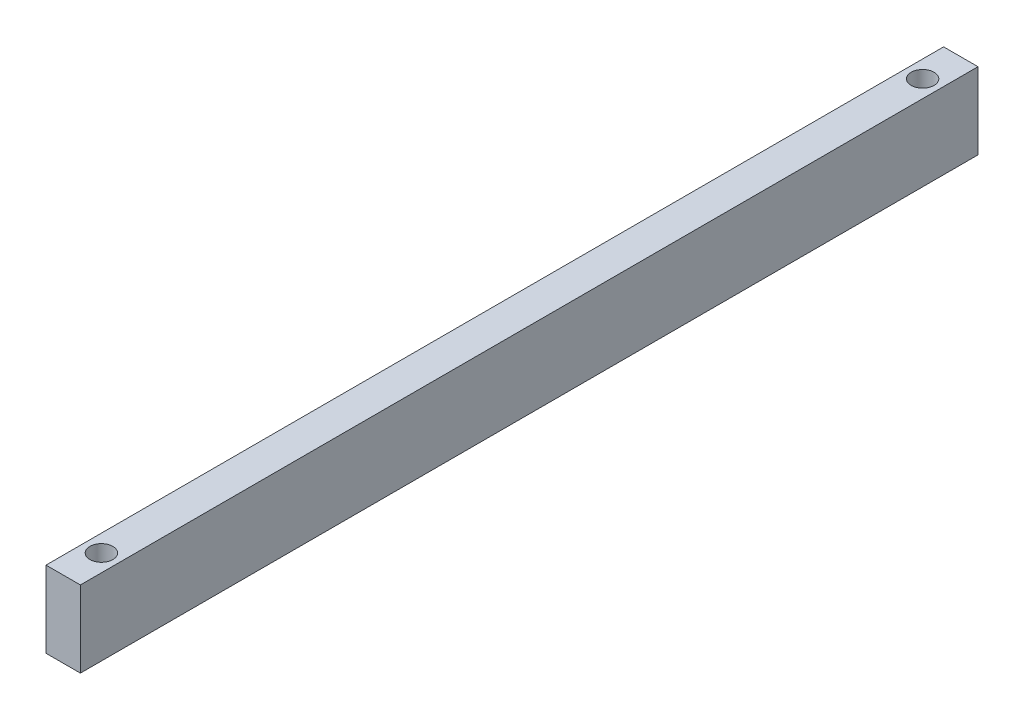
ISO-10303-21;
HEADER;
FILE_DESCRIPTION(('STEP AP214'),'2;1');
FILE_NAME('part.step','',(''),(''),'','','');
FILE_SCHEMA(('AUTOMOTIVE_DESIGN { 1 0 10303 214 1 1 1 1 }'));
ENDSEC;
DATA;
#1=APPLICATION_CONTEXT('core data for automotive mechanical design processes');
#2=APPLICATION_PROTOCOL_DEFINITION('international standard','automotive_design',2000,#1);
#3=PRODUCT_CONTEXT('',#1,'mechanical');
#4=PRODUCT('Part','Part','',(#3));
#5=PRODUCT_RELATED_PRODUCT_CATEGORY('part','',(#4));
#6=PRODUCT_DEFINITION_FORMATION('','',#4);
#7=PRODUCT_DEFINITION_CONTEXT('part definition',#1,'design');
#8=PRODUCT_DEFINITION('design','',#6,#7);
#9=PRODUCT_DEFINITION_SHAPE('','',#8);
#10=(LENGTH_UNIT() NAMED_UNIT(*) SI_UNIT(.MILLI.,.METRE.));
#11=(NAMED_UNIT(*) PLANE_ANGLE_UNIT() SI_UNIT($,.RADIAN.));
#12=(NAMED_UNIT(*) SI_UNIT($,.STERADIAN.) SOLID_ANGLE_UNIT());
#13=UNCERTAINTY_MEASURE_WITH_UNIT(LENGTH_MEASURE(1.E-05),#10,'distance_accuracy_value','');
#14=(GEOMETRIC_REPRESENTATION_CONTEXT(3) GLOBAL_UNCERTAINTY_ASSIGNED_CONTEXT((#13)) GLOBAL_UNIT_ASSIGNED_CONTEXT((#10,
#11,#12)) REPRESENTATION_CONTEXT('',''));
#15=CARTESIAN_POINT('',(0.,0.,0.));
#16=DIRECTION('',(0.,0.,1.));
#17=DIRECTION('',(1.,0.,0.));
#18=AXIS2_PLACEMENT_3D('',#15,#16,#17);
#19=CARTESIAN_POINT('',(4.5,-10.,117.5));
#20=DIRECTION('',(-1.,0.,0.));
#21=DIRECTION('',(0.,0.,1.));
#22=AXIS2_PLACEMENT_3D('',#19,#20,#21);
#23=PLANE('',#22);
#24=DIRECTION('',(0.,1.,0.));
#25=VECTOR('',#24,1.);
#26=CARTESIAN_POINT('',(4.5,-10.,-117.5));
#27=LINE('',#26,#25);
#28=CARTESIAN_POINT('',(4.5,-10.,-117.5));
#29=VERTEX_POINT('',#28);
#30=CARTESIAN_POINT('',(4.5,10.,-117.5));
#31=VERTEX_POINT('',#30);
#32=EDGE_CURVE('E112',#29,#31,#27,.T.);
#33=ORIENTED_EDGE('',*,*,#32,.T.);
#34=DIRECTION('',(0.,0.,-1.));
#35=VECTOR('',#34,1.);
#36=CARTESIAN_POINT('',(4.5,10.,117.5));
#37=LINE('',#36,#35);
#38=CARTESIAN_POINT('',(4.5,10.,117.5));
#39=VERTEX_POINT('',#38);
#40=EDGE_CURVE('E11',#39,#31,#37,.T.);
#41=ORIENTED_EDGE('',*,*,#40,.F.);
#42=DIRECTION('',(0.,1.,0.));
#43=VECTOR('',#42,1.);
#44=CARTESIAN_POINT('',(4.5,-10.,117.5));
#45=LINE('',#44,#43);
#46=CARTESIAN_POINT('',(4.5,-10.,117.5));
#47=VERTEX_POINT('',#46);
#48=EDGE_CURVE('E96',#47,#39,#45,.T.);
#49=ORIENTED_EDGE('',*,*,#48,.F.);
#50=DIRECTION('',(0.,0.,-1.));
#51=VECTOR('',#50,1.);
#52=CARTESIAN_POINT('',(4.5,-10.,117.5));
#53=LINE('',#52,#51);
#54=EDGE_CURVE('E108',#47,#29,#53,.T.);
#55=ORIENTED_EDGE('',*,*,#54,.T.);
#56=EDGE_LOOP('',(#33,#41,#49,#55));
#57=FACE_BOUND('',#56,.T.);
#58=ADVANCED_FACE('F44',(#57),#23,.F.);
#59=CARTESIAN_POINT('',(-4.5,10.,117.5));
#60=DIRECTION('',(0.,-1.,0.));
#61=DIRECTION('',(0.,0.,-1.));
#62=AXIS2_PLACEMENT_3D('',#59,#60,#61);
#63=PLANE('',#62);
#64=CARTESIAN_POINT('',(0.,10.,-107.5));
#65=DIRECTION('',(0.,-1.,0.));
#66=DIRECTION('',(0.,0.,-1.));
#67=AXIS2_PLACEMENT_3D('',#64,#65,#66);
#68=CIRCLE('',#67,3.);
#69=CARTESIAN_POINT('',(0.,10.,-110.5));
#70=VERTEX_POINT('',#69);
#71=EDGE_CURVE('E141',#70,#70,#68,.T.);
#72=ORIENTED_EDGE('',*,*,#71,.T.);
#73=EDGE_LOOP('',(#72));
#74=FACE_BOUND('',#73,.T.);
#75=CARTESIAN_POINT('',(0.,10.,107.5));
#76=DIRECTION('',(0.,1.,0.));
#77=DIRECTION('',(0.,0.,1.));
#78=AXIS2_PLACEMENT_3D('',#75,#76,#77);
#79=CIRCLE('',#78,3.);
#80=CARTESIAN_POINT('',(0.,10.,110.5));
#81=VERTEX_POINT('',#80);
#82=EDGE_CURVE('E133',#81,#81,#79,.T.);
#83=ORIENTED_EDGE('',*,*,#82,.F.);
#84=EDGE_LOOP('',(#83));
#85=FACE_BOUND('',#84,.T.);
#86=DIRECTION('',(-1.,0.,0.));
#87=VECTOR('',#86,1.);
#88=CARTESIAN_POINT('',(-4.5,10.,-117.5));
#89=LINE('',#88,#87);
#90=CARTESIAN_POINT('',(-4.5,10.,-117.5));
#91=VERTEX_POINT('',#90);
#92=EDGE_CURVE('E101',#31,#91,#89,.T.);
#93=ORIENTED_EDGE('',*,*,#92,.T.);
#94=DIRECTION('',(0.,0.,-1.));
#95=VECTOR('',#94,1.);
#96=CARTESIAN_POINT('',(-4.5,10.,117.5));
#97=LINE('',#96,#95);
#98=CARTESIAN_POINT('',(-4.5,10.,117.5));
#99=VERTEX_POINT('',#98);
#100=EDGE_CURVE('E53',#99,#91,#97,.T.);
#101=ORIENTED_EDGE('',*,*,#100,.F.);
#102=DIRECTION('',(-1.,0.,0.));
#103=VECTOR('',#102,1.);
#104=CARTESIAN_POINT('',(-4.5,10.,117.5));
#105=LINE('',#104,#103);
#106=EDGE_CURVE('E91',#39,#99,#105,.T.);
#107=ORIENTED_EDGE('',*,*,#106,.F.);
#108=ORIENTED_EDGE('',*,*,#40,.T.);
#109=EDGE_LOOP('',(#93,#101,#107,#108));
#110=FACE_BOUND('',#109,.T.);
#111=ADVANCED_FACE('F100',(#74,#85,#110),#63,.F.);
#112=CARTESIAN_POINT('',(-4.5,-10.,117.5));
#113=DIRECTION('',(1.,0.,0.));
#114=DIRECTION('',(0.,0.,-1.));
#115=AXIS2_PLACEMENT_3D('',#112,#113,#114);
#116=PLANE('',#115);
#117=DIRECTION('',(0.,-1.,0.));
#118=VECTOR('',#117,1.);
#119=CARTESIAN_POINT('',(-4.5,-10.,-117.5));
#120=LINE('',#119,#118);
#121=CARTESIAN_POINT('',(-4.5,-10.,-117.5));
#122=VERTEX_POINT('',#121);
#123=EDGE_CURVE('E78',#91,#122,#120,.T.);
#124=ORIENTED_EDGE('',*,*,#123,.T.);
#125=DIRECTION('',(0.,0.,-1.));
#126=VECTOR('',#125,1.);
#127=CARTESIAN_POINT('',(-4.5,-10.,117.5));
#128=LINE('',#127,#126);
#129=CARTESIAN_POINT('',(-4.5,-10.,117.5));
#130=VERTEX_POINT('',#129);
#131=EDGE_CURVE('E103',#130,#122,#128,.T.);
#132=ORIENTED_EDGE('',*,*,#131,.F.);
#133=DIRECTION('',(0.,-1.,0.));
#134=VECTOR('',#133,1.);
#135=CARTESIAN_POINT('',(-4.5,-10.,117.5));
#136=LINE('',#135,#134);
#137=EDGE_CURVE('E94',#99,#130,#136,.T.);
#138=ORIENTED_EDGE('',*,*,#137,.F.);
#139=ORIENTED_EDGE('',*,*,#100,.T.);
#140=EDGE_LOOP('',(#124,#132,#138,#139));
#141=FACE_BOUND('',#140,.T.);
#142=ADVANCED_FACE('F104',(#141),#116,.F.);
#143=CARTESIAN_POINT('',(-4.5,-10.,117.5));
#144=DIRECTION('',(0.,1.,0.));
#145=DIRECTION('',(0.,0.,1.));
#146=AXIS2_PLACEMENT_3D('',#143,#144,#145);
#147=PLANE('',#146);
#148=CARTESIAN_POINT('',(0.,-10.,-107.5));
#149=DIRECTION('',(0.,-1.,0.));
#150=DIRECTION('',(0.,0.,-1.));
#151=AXIS2_PLACEMENT_3D('',#148,#149,#150);
#152=CIRCLE('',#151,3.);
#153=CARTESIAN_POINT('',(0.,-10.,-110.5));
#154=VERTEX_POINT('',#153);
#155=EDGE_CURVE('E137',#154,#154,#152,.T.);
#156=ORIENTED_EDGE('',*,*,#155,.F.);
#157=EDGE_LOOP('',(#156));
#158=FACE_BOUND('',#157,.T.);
#159=CARTESIAN_POINT('',(0.,-10.,107.5));
#160=DIRECTION('',(0.,1.,0.));
#161=DIRECTION('',(0.,0.,1.));
#162=AXIS2_PLACEMENT_3D('',#159,#160,#161);
#163=CIRCLE('',#162,3.);
#164=CARTESIAN_POINT('',(0.,-10.,110.5));
#165=VERTEX_POINT('',#164);
#166=EDGE_CURVE('E116',#165,#165,#163,.T.);
#167=ORIENTED_EDGE('',*,*,#166,.T.);
#168=EDGE_LOOP('',(#167));
#169=FACE_BOUND('',#168,.T.);
#170=DIRECTION('',(1.,0.,0.));
#171=VECTOR('',#170,1.);
#172=CARTESIAN_POINT('',(-4.5,-10.,-117.5));
#173=LINE('',#172,#171);
#174=EDGE_CURVE('E84',#122,#29,#173,.T.);
#175=ORIENTED_EDGE('',*,*,#174,.T.);
#176=ORIENTED_EDGE('',*,*,#54,.F.);
#177=DIRECTION('',(1.,0.,0.));
#178=VECTOR('',#177,1.);
#179=CARTESIAN_POINT('',(-4.5,-10.,117.5));
#180=LINE('',#179,#178);
#181=EDGE_CURVE('E61',#130,#47,#180,.T.);
#182=ORIENTED_EDGE('',*,*,#181,.F.);
#183=ORIENTED_EDGE('',*,*,#131,.T.);
#184=EDGE_LOOP('',(#175,#176,#182,#183));
#185=FACE_BOUND('',#184,.T.);
#186=ADVANCED_FACE('F126',(#158,#169,#185),#147,.F.);
#187=CARTESIAN_POINT('',(0.,0.,117.5));
#188=DIRECTION('',(0.,0.,-1.));
#189=DIRECTION('',(-1.,0.,0.));
#190=AXIS2_PLACEMENT_3D('',#187,#188,#189);
#191=PLANE('',#190);
#192=ORIENTED_EDGE('',*,*,#48,.T.);
#193=ORIENTED_EDGE('',*,*,#106,.T.);
#194=ORIENTED_EDGE('',*,*,#137,.T.);
#195=ORIENTED_EDGE('',*,*,#181,.T.);
#196=EDGE_LOOP('',(#192,#193,#194,#195));
#197=FACE_BOUND('',#196,.T.);
#198=ADVANCED_FACE('F92',(#197),#191,.F.);
#199=CARTESIAN_POINT('',(0.,0.,-117.5));
#200=DIRECTION('',(0.,0.,-1.));
#201=DIRECTION('',(-1.,0.,0.));
#202=AXIS2_PLACEMENT_3D('',#199,#200,#201);
#203=PLANE('',#202);
#204=ORIENTED_EDGE('',*,*,#32,.F.);
#205=ORIENTED_EDGE('',*,*,#174,.F.);
#206=ORIENTED_EDGE('',*,*,#123,.F.);
#207=ORIENTED_EDGE('',*,*,#92,.F.);
#208=EDGE_LOOP('',(#204,#205,#206,#207));
#209=FACE_BOUND('',#208,.T.);
#210=ADVANCED_FACE('F129',(#209),#203,.T.);
#211=CARTESIAN_POINT('',(0.,-10.,107.5));
#212=DIRECTION('',(0.,1.,0.));
#213=DIRECTION('',(0.,0.,1.));
#214=AXIS2_PLACEMENT_3D('',#211,#212,#213);
#215=CYLINDRICAL_SURFACE('',#214,3.);
#216=ORIENTED_EDGE('',*,*,#166,.F.);
#217=EDGE_LOOP('',(#216));
#218=FACE_BOUND('',#217,.T.);
#219=ORIENTED_EDGE('',*,*,#82,.T.);
#220=EDGE_LOOP('',(#219));
#221=FACE_BOUND('',#220,.T.);
#222=ADVANCED_FACE('F157',(#218,#221),#215,.F.);
#223=CARTESIAN_POINT('',(0.,-10.,-107.5));
#224=DIRECTION('',(0.,1.,0.));
#225=DIRECTION('',(0.,0.,1.));
#226=AXIS2_PLACEMENT_3D('',#223,#224,#225);
#227=CYLINDRICAL_SURFACE('',#226,3.);
#228=ORIENTED_EDGE('',*,*,#155,.T.);
#229=EDGE_LOOP('',(#228));
#230=FACE_BOUND('',#229,.T.);
#231=ORIENTED_EDGE('',*,*,#71,.F.);
#232=EDGE_LOOP('',(#231));
#233=FACE_BOUND('',#232,.T.);
#234=ADVANCED_FACE('F149',(#230,#233),#227,.F.);
#235=CLOSED_SHELL('',(#58,#111,#142,#186,#198,#210,#222,#234));
#236=MANIFOLD_SOLID_BREP('B2',#235);
#237=ADVANCED_BREP_SHAPE_REPRESENTATION('',(#18,#236),#14);
#238=SHAPE_DEFINITION_REPRESENTATION(#9,#237);
ENDSEC;
END-ISO-10303-21;
